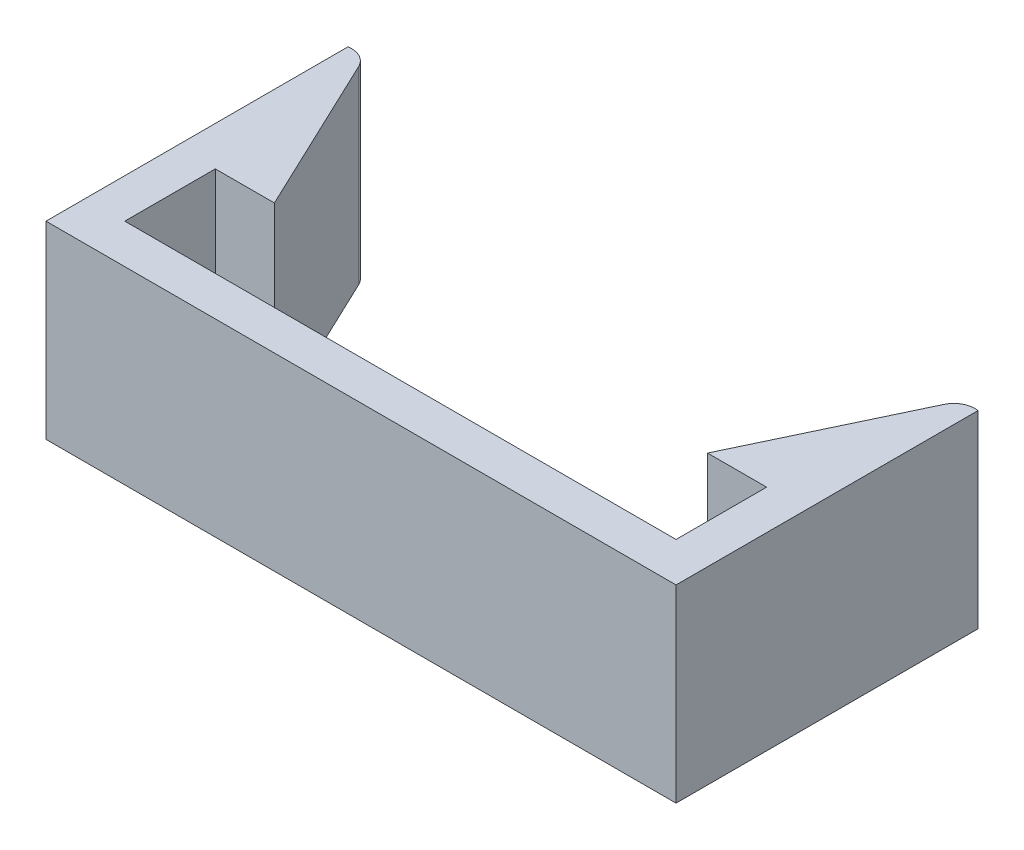
ISO-10303-21;
HEADER;
FILE_DESCRIPTION(('STEP AP214'),'2;1');
FILE_NAME('part.step','',(''),(''),'','','');
FILE_SCHEMA(('AUTOMOTIVE_DESIGN { 1 0 10303 214 1 1 1 1 }'));
ENDSEC;
DATA;
#1=APPLICATION_CONTEXT('core data for automotive mechanical design processes');
#2=APPLICATION_PROTOCOL_DEFINITION('international standard','automotive_design',2000,#1);
#3=PRODUCT_CONTEXT('',#1,'mechanical');
#4=PRODUCT('Part','Part','',(#3));
#5=PRODUCT_RELATED_PRODUCT_CATEGORY('part','',(#4));
#6=PRODUCT_DEFINITION_FORMATION('','',#4);
#7=PRODUCT_DEFINITION_CONTEXT('part definition',#1,'design');
#8=PRODUCT_DEFINITION('design','',#6,#7);
#9=PRODUCT_DEFINITION_SHAPE('','',#8);
#10=(LENGTH_UNIT() NAMED_UNIT(*) SI_UNIT(.MILLI.,.METRE.));
#11=(NAMED_UNIT(*) PLANE_ANGLE_UNIT() SI_UNIT($,.RADIAN.));
#12=(NAMED_UNIT(*) SI_UNIT($,.STERADIAN.) SOLID_ANGLE_UNIT());
#13=UNCERTAINTY_MEASURE_WITH_UNIT(LENGTH_MEASURE(1.E-05),#10,'distance_accuracy_value','');
#14=(GEOMETRIC_REPRESENTATION_CONTEXT(3) GLOBAL_UNCERTAINTY_ASSIGNED_CONTEXT((#13)) GLOBAL_UNIT_ASSIGNED_CONTEXT((#10,
#11,#12)) REPRESENTATION_CONTEXT('',''));
#15=CARTESIAN_POINT('',(0.,0.,0.));
#16=DIRECTION('',(0.,0.,1.));
#17=DIRECTION('',(1.,0.,0.));
#18=AXIS2_PLACEMENT_3D('',#15,#16,#17);
#19=CARTESIAN_POINT('',(-8.,4.8,-1.));
#20=DIRECTION('',(1.,0.,0.));
#21=DIRECTION('',(0.,0.,-1.));
#22=AXIS2_PLACEMENT_3D('',#19,#20,#21);
#23=PLANE('',#22);
#24=DIRECTION('',(0.,0.,1.));
#25=VECTOR('',#24,1.);
#26=CARTESIAN_POINT('',(-8.,0.,-1.));
#27=LINE('',#26,#25);
#28=CARTESIAN_POINT('',(-8.,0.,-7.66804381293919));
#29=VERTEX_POINT('',#28);
#30=CARTESIAN_POINT('',(-8.,0.,0.));
#31=VERTEX_POINT('',#30);
#32=EDGE_CURVE('E104',#29,#31,#27,.T.);
#33=ORIENTED_EDGE('',*,*,#32,.T.);
#34=DIRECTION('',(0.,-1.,0.));
#35=VECTOR('',#34,1.);
#36=CARTESIAN_POINT('',(-8.,4.8,0.));
#37=LINE('',#36,#35);
#38=CARTESIAN_POINT('',(-8.,4.8,0.));
#39=VERTEX_POINT('',#38);
#40=EDGE_CURVE('E11',#39,#31,#37,.T.);
#41=ORIENTED_EDGE('',*,*,#40,.F.);
#42=DIRECTION('',(0.,0.,1.));
#43=VECTOR('',#42,1.);
#44=CARTESIAN_POINT('',(-8.,4.8,-1.));
#45=LINE('',#44,#43);
#46=CARTESIAN_POINT('',(-8.,4.8,-7.66804381293919));
#47=VERTEX_POINT('',#46);
#48=EDGE_CURVE('E110',#47,#39,#45,.T.);
#49=ORIENTED_EDGE('',*,*,#48,.F.);
#50=DIRECTION('',(0.,-1.,0.));
#51=VECTOR('',#50,1.);
#52=CARTESIAN_POINT('',(-8.,4.8,-7.66804381293919));
#53=LINE('',#52,#51);
#54=EDGE_CURVE('E160',#47,#29,#53,.T.);
#55=ORIENTED_EDGE('',*,*,#54,.T.);
#56=EDGE_LOOP('',(#33,#41,#49,#55));
#57=FACE_BOUND('',#56,.T.);
#58=ADVANCED_FACE('F39',(#57),#23,.F.);
#59=CARTESIAN_POINT('',(-8.,4.8,0.));
#60=DIRECTION('',(0.,0.,-1.));
#61=DIRECTION('',(-1.,0.,0.));
#62=AXIS2_PLACEMENT_3D('',#59,#60,#61);
#63=PLANE('',#62);
#64=DIRECTION('',(1.,0.,0.));
#65=VECTOR('',#64,1.);
#66=CARTESIAN_POINT('',(-8.,0.,0.));
#67=LINE('',#66,#65);
#68=CARTESIAN_POINT('',(8.,0.,0.));
#69=VERTEX_POINT('',#68);
#70=EDGE_CURVE('E166',#31,#69,#67,.T.);
#71=ORIENTED_EDGE('',*,*,#70,.T.);
#72=DIRECTION('',(0.,-1.,0.));
#73=VECTOR('',#72,1.);
#74=CARTESIAN_POINT('',(8.,4.8,0.));
#75=LINE('',#74,#73);
#76=CARTESIAN_POINT('',(8.,4.8,0.));
#77=VERTEX_POINT('',#76);
#78=EDGE_CURVE('E48',#77,#69,#75,.T.);
#79=ORIENTED_EDGE('',*,*,#78,.F.);
#80=DIRECTION('',(1.,0.,0.));
#81=VECTOR('',#80,1.);
#82=CARTESIAN_POINT('',(-8.,4.8,0.));
#83=LINE('',#82,#81);
#84=EDGE_CURVE('E239',#39,#77,#83,.T.);
#85=ORIENTED_EDGE('',*,*,#84,.F.);
#86=ORIENTED_EDGE('',*,*,#40,.T.);
#87=EDGE_LOOP('',(#71,#79,#85,#86));
#88=FACE_BOUND('',#87,.T.);
#89=ADVANCED_FACE('F238',(#88),#63,.F.);
#90=CARTESIAN_POINT('',(8.,4.8,-1.));
#91=DIRECTION('',(-1.,0.,0.));
#92=DIRECTION('',(0.,0.,1.));
#93=AXIS2_PLACEMENT_3D('',#90,#91,#92);
#94=PLANE('',#93);
#95=DIRECTION('',(0.,0.,-1.));
#96=VECTOR('',#95,1.);
#97=CARTESIAN_POINT('',(8.,0.,-1.));
#98=LINE('',#97,#96);
#99=CARTESIAN_POINT('',(8.,0.,-7.66804381293919));
#100=VERTEX_POINT('',#99);
#101=EDGE_CURVE('E170',#69,#100,#98,.T.);
#102=ORIENTED_EDGE('',*,*,#101,.T.);
#103=DIRECTION('',(0.,-1.,0.));
#104=VECTOR('',#103,1.);
#105=CARTESIAN_POINT('',(8.,4.8,-7.66804381293919));
#106=LINE('',#105,#104);
#107=CARTESIAN_POINT('',(8.,4.8,-7.66804381293919));
#108=VERTEX_POINT('',#107);
#109=EDGE_CURVE('E225',#108,#100,#106,.T.);
#110=ORIENTED_EDGE('',*,*,#109,.F.);
#111=DIRECTION('',(0.,0.,-1.));
#112=VECTOR('',#111,1.);
#113=CARTESIAN_POINT('',(8.,4.8,-1.));
#114=LINE('',#113,#112);
#115=EDGE_CURVE('E235',#77,#108,#114,.T.);
#116=ORIENTED_EDGE('',*,*,#115,.F.);
#117=ORIENTED_EDGE('',*,*,#78,.T.);
#118=EDGE_LOOP('',(#102,#110,#116,#117));
#119=FACE_BOUND('',#118,.T.);
#120=ADVANCED_FACE('F233',(#119),#94,.F.);
#121=CARTESIAN_POINT('',(7.91211672992138,4.8,-7.1429124452165));
#122=DIRECTION('',(0.,-1.,0.));
#123=DIRECTION('',(0.,0.,-1.));
#124=AXIS2_PLACEMENT_3D('',#121,#122,#123);
#125=CYLINDRICAL_SURFACE('',#124,0.532434430259745);
#126=CARTESIAN_POINT('',(7.91211672992138,0.,-7.1429124452165));
#127=DIRECTION('',(0.,1.,0.));
#128=DIRECTION('',(0.,0.,-1.));
#129=AXIS2_PLACEMENT_3D('',#126,#127,#128);
#130=CIRCLE('',#129,0.532434430259745);
#131=CARTESIAN_POINT('',(7.43105647598099,0.,-7.37109538630726));
#132=VERTEX_POINT('',#131);
#133=EDGE_CURVE('E173',#100,#132,#130,.T.);
#134=ORIENTED_EDGE('',*,*,#133,.T.);
#135=DIRECTION('',(0.,-1.,0.));
#136=VECTOR('',#135,1.);
#137=CARTESIAN_POINT('',(7.43105647598099,4.8,-7.37109538630726));
#138=LINE('',#137,#136);
#139=CARTESIAN_POINT('',(7.43105647598099,4.8,-7.37109538630726));
#140=VERTEX_POINT('',#139);
#141=EDGE_CURVE('E221',#140,#132,#138,.T.);
#142=ORIENTED_EDGE('',*,*,#141,.F.);
#143=CARTESIAN_POINT('',(7.91211672992138,4.8,-7.1429124452165));
#144=DIRECTION('',(0.,1.,0.));
#145=DIRECTION('',(0.,0.,-1.));
#146=AXIS2_PLACEMENT_3D('',#143,#144,#145);
#147=CIRCLE('',#146,0.532434430259745);
#148=EDGE_CURVE('E256',#108,#140,#147,.T.);
#149=ORIENTED_EDGE('',*,*,#148,.F.);
#150=ORIENTED_EDGE('',*,*,#109,.T.);
#151=EDGE_LOOP('',(#134,#142,#149,#150));
#152=FACE_BOUND('',#151,.T.);
#153=ADVANCED_FACE('F246',(#152),#125,.T.);
#154=CARTESIAN_POINT('',(7.43105647598099,4.8,-7.37109538630726));
#155=DIRECTION('',(0.903510792316158,0.,0.428565337105357));
#156=DIRECTION('',(0.428565337105357,0.,-0.903510792316158));
#157=AXIS2_PLACEMENT_3D('',#154,#155,#156);
#158=PLANE('',#157);
#159=DIRECTION('',(-0.428565337105357,0.,0.903510792316158));
#160=VECTOR('',#159,1.);
#161=CARTESIAN_POINT('',(7.43105647598099,0.,-7.37109538630726));
#162=LINE('',#161,#160);
#163=CARTESIAN_POINT('',(5.5,0.,-3.3));
#164=VERTEX_POINT('',#163);
#165=EDGE_CURVE('E176',#132,#164,#162,.T.);
#166=ORIENTED_EDGE('',*,*,#165,.T.);
#167=DIRECTION('',(0.,-1.,0.));
#168=VECTOR('',#167,1.);
#169=CARTESIAN_POINT('',(5.5,4.8,-3.3));
#170=LINE('',#169,#168);
#171=CARTESIAN_POINT('',(5.5,4.8,-3.3));
#172=VERTEX_POINT('',#171);
#173=EDGE_CURVE('E217',#172,#164,#170,.T.);
#174=ORIENTED_EDGE('',*,*,#173,.F.);
#175=DIRECTION('',(-0.428565337105357,0.,0.903510792316158));
#176=VECTOR('',#175,1.);
#177=CARTESIAN_POINT('',(7.43105647598099,4.8,-7.37109538630726));
#178=LINE('',#177,#176);
#179=EDGE_CURVE('E252',#140,#172,#178,.T.);
#180=ORIENTED_EDGE('',*,*,#179,.F.);
#181=ORIENTED_EDGE('',*,*,#141,.T.);
#182=EDGE_LOOP('',(#166,#174,#180,#181));
#183=FACE_BOUND('',#182,.T.);
#184=ADVANCED_FACE('F250',(#183),#158,.F.);
#185=CARTESIAN_POINT('',(5.5,4.8,-3.3));
#186=DIRECTION('',(0.,0.,-1.));
#187=DIRECTION('',(-1.,0.,0.));
#188=AXIS2_PLACEMENT_3D('',#185,#186,#187);
#189=PLANE('',#188);
#190=DIRECTION('',(1.,0.,0.));
#191=VECTOR('',#190,1.);
#192=CARTESIAN_POINT('',(5.5,0.,-3.3));
#193=LINE('',#192,#191);
#194=CARTESIAN_POINT('',(7.,0.,-3.3));
#195=VERTEX_POINT('',#194);
#196=EDGE_CURVE('E179',#164,#195,#193,.T.);
#197=ORIENTED_EDGE('',*,*,#196,.T.);
#198=DIRECTION('',(0.,-1.,0.));
#199=VECTOR('',#198,1.);
#200=CARTESIAN_POINT('',(7.,4.8,-3.3));
#201=LINE('',#200,#199);
#202=CARTESIAN_POINT('',(7.,4.8,-3.3));
#203=VERTEX_POINT('',#202);
#204=EDGE_CURVE('E213',#203,#195,#201,.T.);
#205=ORIENTED_EDGE('',*,*,#204,.F.);
#206=DIRECTION('',(1.,0.,0.));
#207=VECTOR('',#206,1.);
#208=CARTESIAN_POINT('',(5.5,4.8,-3.3));
#209=LINE('',#208,#207);
#210=EDGE_CURVE('E255',#172,#203,#209,.T.);
#211=ORIENTED_EDGE('',*,*,#210,.F.);
#212=ORIENTED_EDGE('',*,*,#173,.T.);
#213=EDGE_LOOP('',(#197,#205,#211,#212));
#214=FACE_BOUND('',#213,.T.);
#215=ADVANCED_FACE('F301',(#214),#189,.F.);
#216=CARTESIAN_POINT('',(7.,4.8,-3.3));
#217=DIRECTION('',(1.,0.,0.));
#218=DIRECTION('',(0.,0.,-1.));
#219=AXIS2_PLACEMENT_3D('',#216,#217,#218);
#220=PLANE('',#219);
#221=DIRECTION('',(0.,0.,1.));
#222=VECTOR('',#221,1.);
#223=CARTESIAN_POINT('',(7.,0.,-3.3));
#224=LINE('',#223,#222);
#225=CARTESIAN_POINT('',(7.,0.,-1.));
#226=VERTEX_POINT('',#225);
#227=EDGE_CURVE('E182',#195,#226,#224,.T.);
#228=ORIENTED_EDGE('',*,*,#227,.T.);
#229=DIRECTION('',(0.,-1.,0.));
#230=VECTOR('',#229,1.);
#231=CARTESIAN_POINT('',(7.,4.8,-1.));
#232=LINE('',#231,#230);
#233=CARTESIAN_POINT('',(7.,4.8,-1.));
#234=VERTEX_POINT('',#233);
#235=EDGE_CURVE('E209',#234,#226,#232,.T.);
#236=ORIENTED_EDGE('',*,*,#235,.F.);
#237=DIRECTION('',(0.,0.,1.));
#238=VECTOR('',#237,1.);
#239=CARTESIAN_POINT('',(7.,4.8,-3.3));
#240=LINE('',#239,#238);
#241=EDGE_CURVE('E260',#203,#234,#240,.T.);
#242=ORIENTED_EDGE('',*,*,#241,.F.);
#243=ORIENTED_EDGE('',*,*,#204,.T.);
#244=EDGE_LOOP('',(#228,#236,#242,#243));
#245=FACE_BOUND('',#244,.T.);
#246=ADVANCED_FACE('F304',(#245),#220,.F.);
#247=CARTESIAN_POINT('',(-7.,4.8,-1.));
#248=DIRECTION('',(0.,0.,1.));
#249=DIRECTION('',(1.,0.,0.));
#250=AXIS2_PLACEMENT_3D('',#247,#248,#249);
#251=PLANE('',#250);
#252=DIRECTION('',(-1.,0.,0.));
#253=VECTOR('',#252,1.);
#254=CARTESIAN_POINT('',(-7.,0.,-1.));
#255=LINE('',#254,#253);
#256=CARTESIAN_POINT('',(-7.,0.,-1.));
#257=VERTEX_POINT('',#256);
#258=EDGE_CURVE('E185',#226,#257,#255,.T.);
#259=ORIENTED_EDGE('',*,*,#258,.T.);
#260=DIRECTION('',(0.,-1.,0.));
#261=VECTOR('',#260,1.);
#262=CARTESIAN_POINT('',(-7.,4.8,-1.));
#263=LINE('',#262,#261);
#264=CARTESIAN_POINT('',(-7.,4.8,-1.));
#265=VERTEX_POINT('',#264);
#266=EDGE_CURVE('E205',#265,#257,#263,.T.);
#267=ORIENTED_EDGE('',*,*,#266,.F.);
#268=DIRECTION('',(-1.,0.,0.));
#269=VECTOR('',#268,1.);
#270=CARTESIAN_POINT('',(-7.,4.8,-1.));
#271=LINE('',#270,#269);
#272=EDGE_CURVE('E267',#234,#265,#271,.T.);
#273=ORIENTED_EDGE('',*,*,#272,.F.);
#274=ORIENTED_EDGE('',*,*,#235,.T.);
#275=EDGE_LOOP('',(#259,#267,#273,#274));
#276=FACE_BOUND('',#275,.T.);
#277=ADVANCED_FACE('F275',(#276),#251,.F.);
#278=CARTESIAN_POINT('',(-7.,4.8,-3.3));
#279=DIRECTION('',(-1.,0.,0.));
#280=DIRECTION('',(0.,0.,1.));
#281=AXIS2_PLACEMENT_3D('',#278,#279,#280);
#282=PLANE('',#281);
#283=DIRECTION('',(0.,0.,-1.));
#284=VECTOR('',#283,1.);
#285=CARTESIAN_POINT('',(-7.,0.,-3.3));
#286=LINE('',#285,#284);
#287=CARTESIAN_POINT('',(-7.,0.,-3.3));
#288=VERTEX_POINT('',#287);
#289=EDGE_CURVE('E188',#257,#288,#286,.T.);
#290=ORIENTED_EDGE('',*,*,#289,.T.);
#291=DIRECTION('',(0.,-1.,0.));
#292=VECTOR('',#291,1.);
#293=CARTESIAN_POINT('',(-7.,4.8,-3.3));
#294=LINE('',#293,#292);
#295=CARTESIAN_POINT('',(-7.,4.8,-3.3));
#296=VERTEX_POINT('',#295);
#297=EDGE_CURVE('E153',#296,#288,#294,.T.);
#298=ORIENTED_EDGE('',*,*,#297,.F.);
#299=DIRECTION('',(0.,0.,-1.));
#300=VECTOR('',#299,1.);
#301=CARTESIAN_POINT('',(-7.,4.8,-3.3));
#302=LINE('',#301,#300);
#303=EDGE_CURVE('E142',#265,#296,#302,.T.);
#304=ORIENTED_EDGE('',*,*,#303,.F.);
#305=ORIENTED_EDGE('',*,*,#266,.T.);
#306=EDGE_LOOP('',(#290,#298,#304,#305));
#307=FACE_BOUND('',#306,.T.);
#308=ADVANCED_FACE('F279',(#307),#282,.F.);
#309=CARTESIAN_POINT('',(-5.5,4.8,-3.3));
#310=DIRECTION('',(0.,0.,-1.));
#311=DIRECTION('',(-1.,0.,0.));
#312=AXIS2_PLACEMENT_3D('',#309,#310,#311);
#313=PLANE('',#312);
#314=DIRECTION('',(1.,0.,0.));
#315=VECTOR('',#314,1.);
#316=CARTESIAN_POINT('',(-5.5,0.,-3.3));
#317=LINE('',#316,#315);
#318=CARTESIAN_POINT('',(-5.5,0.,-3.3));
#319=VERTEX_POINT('',#318);
#320=EDGE_CURVE('E151',#288,#319,#317,.T.);
#321=ORIENTED_EDGE('',*,*,#320,.T.);
#322=DIRECTION('',(0.,-1.,0.));
#323=VECTOR('',#322,1.);
#324=CARTESIAN_POINT('',(-5.5,4.8,-3.3));
#325=LINE('',#324,#323);
#326=CARTESIAN_POINT('',(-5.5,4.8,-3.3));
#327=VERTEX_POINT('',#326);
#328=EDGE_CURVE('E148',#327,#319,#325,.T.);
#329=ORIENTED_EDGE('',*,*,#328,.F.);
#330=DIRECTION('',(1.,0.,0.));
#331=VECTOR('',#330,1.);
#332=CARTESIAN_POINT('',(-5.5,4.8,-3.3));
#333=LINE('',#332,#331);
#334=EDGE_CURVE('E136',#296,#327,#333,.T.);
#335=ORIENTED_EDGE('',*,*,#334,.F.);
#336=ORIENTED_EDGE('',*,*,#297,.T.);
#337=EDGE_LOOP('',(#321,#329,#335,#336));
#338=FACE_BOUND('',#337,.T.);
#339=ADVANCED_FACE('F149',(#338),#313,.F.);
#340=CARTESIAN_POINT('',(-7.43105647598099,4.8,-7.37109538630726));
#341=DIRECTION('',(-0.903510792316158,0.,0.428565337105357));
#342=DIRECTION('',(0.428565337105357,0.,0.903510792316158));
#343=AXIS2_PLACEMENT_3D('',#340,#341,#342);
#344=PLANE('',#343);
#345=DIRECTION('',(-0.428565337105357,0.,-0.903510792316158));
#346=VECTOR('',#345,1.);
#347=CARTESIAN_POINT('',(-7.43105647598099,0.,-7.37109538630726));
#348=LINE('',#347,#346);
#349=CARTESIAN_POINT('',(-7.43105647598099,0.,-7.37109538630726));
#350=VERTEX_POINT('',#349);
#351=EDGE_CURVE('E97',#319,#350,#348,.T.);
#352=ORIENTED_EDGE('',*,*,#351,.T.);
#353=DIRECTION('',(0.,-1.,0.));
#354=VECTOR('',#353,1.);
#355=CARTESIAN_POINT('',(-7.43105647598099,4.8,-7.37109538630726));
#356=LINE('',#355,#354);
#357=CARTESIAN_POINT('',(-7.43105647598099,4.8,-7.37109538630726));
#358=VERTEX_POINT('',#357);
#359=EDGE_CURVE('E154',#358,#350,#356,.T.);
#360=ORIENTED_EDGE('',*,*,#359,.F.);
#361=DIRECTION('',(-0.428565337105357,0.,-0.903510792316158));
#362=VECTOR('',#361,1.);
#363=CARTESIAN_POINT('',(-7.43105647598099,4.8,-7.37109538630726));
#364=LINE('',#363,#362);
#365=EDGE_CURVE('E140',#327,#358,#364,.T.);
#366=ORIENTED_EDGE('',*,*,#365,.F.);
#367=ORIENTED_EDGE('',*,*,#328,.T.);
#368=EDGE_LOOP('',(#352,#360,#366,#367));
#369=FACE_BOUND('',#368,.T.);
#370=ADVANCED_FACE('F156',(#369),#344,.F.);
#371=CARTESIAN_POINT('',(-7.91211672992138,4.8,-7.1429124452165));
#372=DIRECTION('',(0.,-1.,0.));
#373=DIRECTION('',(0.,0.,-1.));
#374=AXIS2_PLACEMENT_3D('',#371,#372,#373);
#375=CYLINDRICAL_SURFACE('',#374,0.532434430259745);
#376=CARTESIAN_POINT('',(-7.91211672992138,0.,-7.1429124452165));
#377=DIRECTION('',(0.,1.,0.));
#378=DIRECTION('',(0.,0.,1.));
#379=AXIS2_PLACEMENT_3D('',#376,#377,#378);
#380=CIRCLE('',#379,0.532434430259745);
#381=EDGE_CURVE('E195',#350,#29,#380,.T.);
#382=ORIENTED_EDGE('',*,*,#381,.T.);
#383=ORIENTED_EDGE('',*,*,#54,.F.);
#384=CARTESIAN_POINT('',(-7.91211672992138,4.8,-7.1429124452165));
#385=DIRECTION('',(0.,1.,0.));
#386=DIRECTION('',(0.,0.,1.));
#387=AXIS2_PLACEMENT_3D('',#384,#385,#386);
#388=CIRCLE('',#387,0.532434430259745);
#389=EDGE_CURVE('E56',#358,#47,#388,.T.);
#390=ORIENTED_EDGE('',*,*,#389,.F.);
#391=ORIENTED_EDGE('',*,*,#359,.T.);
#392=EDGE_LOOP('',(#382,#383,#390,#391));
#393=FACE_BOUND('',#392,.T.);
#394=ADVANCED_FACE('F281',(#393),#375,.T.);
#395=CARTESIAN_POINT('',(-7.91211672992138,4.8,-7.1429124452165));
#396=DIRECTION('',(0.,1.,0.));
#397=DIRECTION('',(0.,0.,1.));
#398=AXIS2_PLACEMENT_3D('',#395,#396,#397);
#399=PLANE('',#398);
#400=ORIENTED_EDGE('',*,*,#48,.T.);
#401=ORIENTED_EDGE('',*,*,#84,.T.);
#402=ORIENTED_EDGE('',*,*,#115,.T.);
#403=ORIENTED_EDGE('',*,*,#148,.T.);
#404=ORIENTED_EDGE('',*,*,#179,.T.);
#405=ORIENTED_EDGE('',*,*,#210,.T.);
#406=ORIENTED_EDGE('',*,*,#241,.T.);
#407=ORIENTED_EDGE('',*,*,#272,.T.);
#408=ORIENTED_EDGE('',*,*,#303,.T.);
#409=ORIENTED_EDGE('',*,*,#334,.T.);
#410=ORIENTED_EDGE('',*,*,#365,.T.);
#411=ORIENTED_EDGE('',*,*,#389,.T.);
#412=EDGE_LOOP('',(#400,#401,#402,#403,#404,#405,#406,#407,#408,#409,#410,#411));
#413=FACE_BOUND('',#412,.T.);
#414=ADVANCED_FACE('F138',(#413),#399,.T.);
#415=CARTESIAN_POINT('',(-7.91211672992138,0.,-7.1429124452165));
#416=DIRECTION('',(0.,1.,0.));
#417=DIRECTION('',(0.,0.,1.));
#418=AXIS2_PLACEMENT_3D('',#415,#416,#417);
#419=PLANE('',#418);
#420=ORIENTED_EDGE('',*,*,#32,.F.);
#421=ORIENTED_EDGE('',*,*,#381,.F.);
#422=ORIENTED_EDGE('',*,*,#351,.F.);
#423=ORIENTED_EDGE('',*,*,#320,.F.);
#424=ORIENTED_EDGE('',*,*,#289,.F.);
#425=ORIENTED_EDGE('',*,*,#258,.F.);
#426=ORIENTED_EDGE('',*,*,#227,.F.);
#427=ORIENTED_EDGE('',*,*,#196,.F.);
#428=ORIENTED_EDGE('',*,*,#165,.F.);
#429=ORIENTED_EDGE('',*,*,#133,.F.);
#430=ORIENTED_EDGE('',*,*,#101,.F.);
#431=ORIENTED_EDGE('',*,*,#70,.F.);
#432=EDGE_LOOP('',(#420,#421,#422,#423,#424,#425,#426,#427,#428,#429,#430,#431));
#433=FACE_BOUND('',#432,.T.);
#434=ADVANCED_FACE('F240',(#433),#419,.F.);
#435=CLOSED_SHELL('',(#58,#89,#120,#153,#184,#215,#246,#277,#308,#339,#370,#394,#414,#434));
#436=MANIFOLD_SOLID_BREP('B2',#435);
#437=ADVANCED_BREP_SHAPE_REPRESENTATION('',(#18,#436),#14);
#438=SHAPE_DEFINITION_REPRESENTATION(#9,#437);
ENDSEC;
END-ISO-10303-21;
